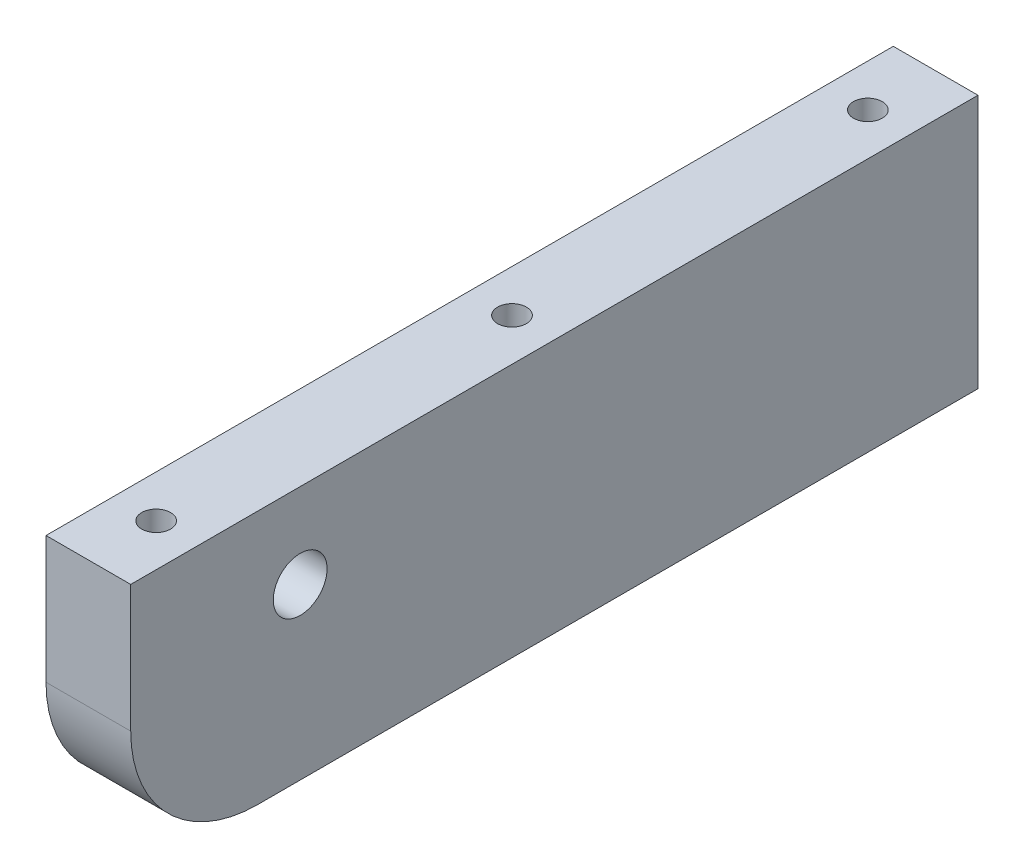
ISO-10303-21;
HEADER;
FILE_DESCRIPTION(('STEP AP214'),'2;1');
FILE_NAME('part.step','',(''),(''),'','','');
FILE_SCHEMA(('AUTOMOTIVE_DESIGN { 1 0 10303 214 1 1 1 1 }'));
ENDSEC;
DATA;
#1=APPLICATION_CONTEXT('core data for automotive mechanical design processes');
#2=APPLICATION_PROTOCOL_DEFINITION('international standard','automotive_design',2000,#1);
#3=PRODUCT_CONTEXT('',#1,'mechanical');
#4=PRODUCT('Part','Part','',(#3));
#5=PRODUCT_RELATED_PRODUCT_CATEGORY('part','',(#4));
#6=PRODUCT_DEFINITION_FORMATION('','',#4);
#7=PRODUCT_DEFINITION_CONTEXT('part definition',#1,'design');
#8=PRODUCT_DEFINITION('design','',#6,#7);
#9=PRODUCT_DEFINITION_SHAPE('','',#8);
#10=(LENGTH_UNIT() NAMED_UNIT(*) SI_UNIT(.MILLI.,.METRE.));
#11=(NAMED_UNIT(*) PLANE_ANGLE_UNIT() SI_UNIT($,.RADIAN.));
#12=(NAMED_UNIT(*) SI_UNIT($,.STERADIAN.) SOLID_ANGLE_UNIT());
#13=UNCERTAINTY_MEASURE_WITH_UNIT(LENGTH_MEASURE(1.E-05),#10,'distance_accuracy_value','');
#14=(GEOMETRIC_REPRESENTATION_CONTEXT(3) GLOBAL_UNCERTAINTY_ASSIGNED_CONTEXT((#13)) GLOBAL_UNIT_ASSIGNED_CONTEXT((#10,
#11,#12)) REPRESENTATION_CONTEXT('',''));
#15=CARTESIAN_POINT('',(0.,0.,0.));
#16=DIRECTION('',(0.,0.,1.));
#17=DIRECTION('',(1.,0.,0.));
#18=AXIS2_PLACEMENT_3D('',#15,#16,#17);
#19=CARTESIAN_POINT('',(10.,-15.,0.));
#20=DIRECTION('',(0.,1.,0.));
#21=DIRECTION('',(0.,0.,1.));
#22=AXIS2_PLACEMENT_3D('',#19,#20,#21);
#23=PLANE('',#22);
#24=DIRECTION('',(0.,0.,-1.));
#25=VECTOR('',#24,1.);
#26=CARTESIAN_POINT('',(10.,-15.,0.));
#27=LINE('',#26,#25);
#28=CARTESIAN_POINT('',(10.,-15.,35.));
#29=VERTEX_POINT('',#28);
#30=CARTESIAN_POINT('',(10.,-15.,-50.));
#31=VERTEX_POINT('',#30);
#32=EDGE_CURVE('E119',#29,#31,#27,.T.);
#33=ORIENTED_EDGE('',*,*,#32,.F.);
#34=DIRECTION('',(-1.,0.,0.));
#35=VECTOR('',#34,1.);
#36=CARTESIAN_POINT('',(0.,-15.,35.));
#37=LINE('',#36,#35);
#38=CARTESIAN_POINT('',(0.,-15.,35.));
#39=VERTEX_POINT('',#38);
#40=EDGE_CURVE('E149',#29,#39,#37,.T.);
#41=ORIENTED_EDGE('',*,*,#40,.T.);
#42=DIRECTION('',(0.,0.,-1.));
#43=VECTOR('',#42,1.);
#44=CARTESIAN_POINT('',(0.,-15.,0.));
#45=LINE('',#44,#43);
#46=CARTESIAN_POINT('',(0.,-15.,-50.));
#47=VERTEX_POINT('',#46);
#48=EDGE_CURVE('E133',#39,#47,#45,.T.);
#49=ORIENTED_EDGE('',*,*,#48,.T.);
#50=DIRECTION('',(-1.,0.,0.));
#51=VECTOR('',#50,1.);
#52=CARTESIAN_POINT('',(10.,-15.,-50.));
#53=LINE('',#52,#51);
#54=EDGE_CURVE('E146',#31,#47,#53,.T.);
#55=ORIENTED_EDGE('',*,*,#54,.F.);
#56=EDGE_LOOP('',(#33,#41,#49,#55));
#57=FACE_BOUND('',#56,.T.);
#58=ADVANCED_FACE('F41',(#57),#23,.F.);
#59=CARTESIAN_POINT('',(10.,0.,-50.));
#60=DIRECTION('',(0.,0.,1.));
#61=DIRECTION('',(1.,0.,0.));
#62=AXIS2_PLACEMENT_3D('',#59,#60,#61);
#63=PLANE('',#62);
#64=DIRECTION('',(0.,1.,0.));
#65=VECTOR('',#64,1.);
#66=CARTESIAN_POINT('',(0.,0.,-50.));
#67=LINE('',#66,#65);
#68=CARTESIAN_POINT('',(0.,15.,-50.));
#69=VERTEX_POINT('',#68);
#70=EDGE_CURVE('E135',#47,#69,#67,.T.);
#71=ORIENTED_EDGE('',*,*,#70,.T.);
#72=DIRECTION('',(-1.,0.,0.));
#73=VECTOR('',#72,1.);
#74=CARTESIAN_POINT('',(10.,15.,-50.));
#75=LINE('',#74,#73);
#76=CARTESIAN_POINT('',(10.,15.,-50.));
#77=VERTEX_POINT('',#76);
#78=EDGE_CURVE('E144',#77,#69,#75,.T.);
#79=ORIENTED_EDGE('',*,*,#78,.F.);
#80=DIRECTION('',(0.,1.,0.));
#81=VECTOR('',#80,1.);
#82=CARTESIAN_POINT('',(10.,0.,-50.));
#83=LINE('',#82,#81);
#84=EDGE_CURVE('E122',#31,#77,#83,.T.);
#85=ORIENTED_EDGE('',*,*,#84,.F.);
#86=ORIENTED_EDGE('',*,*,#54,.T.);
#87=EDGE_LOOP('',(#71,#79,#85,#86));
#88=FACE_BOUND('',#87,.T.);
#89=ADVANCED_FACE('F164',(#88),#63,.F.);
#90=CARTESIAN_POINT('',(10.,15.,0.));
#91=DIRECTION('',(0.,1.,0.));
#92=DIRECTION('',(0.,0.,1.));
#93=AXIS2_PLACEMENT_3D('',#90,#91,#92);
#94=PLANE('',#93);
#95=CARTESIAN_POINT('',(5.,15.,-42.));
#96=DIRECTION('',(0.,1.,0.));
#97=DIRECTION('',(0.,0.,1.));
#98=AXIS2_PLACEMENT_3D('',#95,#96,#97);
#99=CIRCLE('',#98,1.7);
#100=CARTESIAN_POINT('',(5.,15.,-40.3));
#101=VERTEX_POINT('',#100);
#102=EDGE_CURVE('E45',#101,#101,#99,.T.);
#103=ORIENTED_EDGE('',*,*,#102,.F.);
#104=EDGE_LOOP('',(#103));
#105=FACE_BOUND('',#104,.T.);
#106=CARTESIAN_POINT('',(5.,15.,42.));
#107=DIRECTION('',(0.,1.,0.));
#108=DIRECTION('',(0.,0.,1.));
#109=AXIS2_PLACEMENT_3D('',#106,#107,#108);
#110=CIRCLE('',#109,1.7);
#111=CARTESIAN_POINT('',(5.,15.,43.7));
#112=VERTEX_POINT('',#111);
#113=EDGE_CURVE('E111',#112,#112,#110,.T.);
#114=ORIENTED_EDGE('',*,*,#113,.F.);
#115=EDGE_LOOP('',(#114));
#116=FACE_BOUND('',#115,.T.);
#117=CARTESIAN_POINT('',(5.,15.,0.));
#118=DIRECTION('',(0.,1.,0.));
#119=DIRECTION('',(0.,0.,1.));
#120=AXIS2_PLACEMENT_3D('',#117,#118,#119);
#121=CIRCLE('',#120,1.7);
#122=CARTESIAN_POINT('',(5.,15.,1.7));
#123=VERTEX_POINT('',#122);
#124=EDGE_CURVE('E115',#123,#123,#121,.T.);
#125=ORIENTED_EDGE('',*,*,#124,.F.);
#126=EDGE_LOOP('',(#125));
#127=FACE_BOUND('',#126,.T.);
#128=DIRECTION('',(0.,0.,-1.));
#129=VECTOR('',#128,1.);
#130=CARTESIAN_POINT('',(0.,15.,0.));
#131=LINE('',#130,#129);
#132=CARTESIAN_POINT('',(0.,15.,50.));
#133=VERTEX_POINT('',#132);
#134=EDGE_CURVE('E138',#133,#69,#131,.T.);
#135=ORIENTED_EDGE('',*,*,#134,.F.);
#136=DIRECTION('',(-1.,0.,0.));
#137=VECTOR('',#136,1.);
#138=CARTESIAN_POINT('',(10.,15.,50.));
#139=LINE('',#138,#137);
#140=CARTESIAN_POINT('',(10.,15.,50.));
#141=VERTEX_POINT('',#140);
#142=EDGE_CURVE('E129',#141,#133,#139,.T.);
#143=ORIENTED_EDGE('',*,*,#142,.F.);
#144=DIRECTION('',(0.,0.,-1.));
#145=VECTOR('',#144,1.);
#146=CARTESIAN_POINT('',(10.,15.,0.));
#147=LINE('',#146,#145);
#148=EDGE_CURVE('E124',#141,#77,#147,.T.);
#149=ORIENTED_EDGE('',*,*,#148,.T.);
#150=ORIENTED_EDGE('',*,*,#78,.T.);
#151=EDGE_LOOP('',(#135,#143,#149,#150));
#152=FACE_BOUND('',#151,.T.);
#153=ADVANCED_FACE('F160',(#105,#116,#127,#152),#94,.T.);
#154=CARTESIAN_POINT('',(10.,5.,30.));
#155=DIRECTION('',(-1.,0.,0.));
#156=DIRECTION('',(0.,0.,1.));
#157=AXIS2_PLACEMENT_3D('',#154,#155,#156);
#158=CYLINDRICAL_SURFACE('',#157,3.175);
#159=CARTESIAN_POINT('',(10.,5.,30.));
#160=DIRECTION('',(1.,0.,0.));
#161=DIRECTION('',(0.,0.,-1.));
#162=AXIS2_PLACEMENT_3D('',#159,#160,#161);
#163=CIRCLE('',#162,3.175);
#164=CARTESIAN_POINT('',(10.,5.,26.825));
#165=VERTEX_POINT('',#164);
#166=EDGE_CURVE('E116',#165,#165,#163,.T.);
#167=ORIENTED_EDGE('',*,*,#166,.T.);
#168=EDGE_LOOP('',(#167));
#169=FACE_BOUND('',#168,.T.);
#170=CARTESIAN_POINT('',(0.,5.,30.));
#171=DIRECTION('',(1.,0.,0.));
#172=DIRECTION('',(0.,0.,-1.));
#173=AXIS2_PLACEMENT_3D('',#170,#171,#172);
#174=CIRCLE('',#173,3.175);
#175=CARTESIAN_POINT('',(0.,5.,26.825));
#176=VERTEX_POINT('',#175);
#177=EDGE_CURVE('E130',#176,#176,#174,.T.);
#178=ORIENTED_EDGE('',*,*,#177,.F.);
#179=EDGE_LOOP('',(#178));
#180=FACE_BOUND('',#179,.T.);
#181=ADVANCED_FACE('F163',(#169,#180),#158,.F.);
#182=CARTESIAN_POINT('',(10.,0.,50.));
#183=DIRECTION('',(0.,0.,1.));
#184=DIRECTION('',(1.,0.,0.));
#185=AXIS2_PLACEMENT_3D('',#182,#183,#184);
#186=PLANE('',#185);
#187=DIRECTION('',(0.,1.,0.));
#188=VECTOR('',#187,1.);
#189=CARTESIAN_POINT('',(0.,0.,50.));
#190=LINE('',#189,#188);
#191=CARTESIAN_POINT('',(0.,0.,50.));
#192=VERTEX_POINT('',#191);
#193=EDGE_CURVE('E120',#192,#133,#190,.T.);
#194=ORIENTED_EDGE('',*,*,#193,.F.);
#195=DIRECTION('',(-1.,0.,0.));
#196=VECTOR('',#195,1.);
#197=CARTESIAN_POINT('',(10.,0.,50.));
#198=LINE('',#197,#196);
#199=CARTESIAN_POINT('',(10.,0.,50.));
#200=VERTEX_POINT('',#199);
#201=EDGE_CURVE('E50',#192,#200,#198,.F.);
#202=ORIENTED_EDGE('',*,*,#201,.T.);
#203=DIRECTION('',(0.,1.,0.));
#204=VECTOR('',#203,1.);
#205=CARTESIAN_POINT('',(10.,0.,50.));
#206=LINE('',#205,#204);
#207=EDGE_CURVE('E127',#200,#141,#206,.T.);
#208=ORIENTED_EDGE('',*,*,#207,.T.);
#209=ORIENTED_EDGE('',*,*,#142,.T.);
#210=EDGE_LOOP('',(#194,#202,#208,#209));
#211=FACE_BOUND('',#210,.T.);
#212=ADVANCED_FACE('F175',(#211),#186,.T.);
#213=CARTESIAN_POINT('',(10.,0.,0.));
#214=DIRECTION('',(1.,0.,0.));
#215=DIRECTION('',(0.,0.,-1.));
#216=AXIS2_PLACEMENT_3D('',#213,#214,#215);
#217=PLANE('',#216);
#218=ORIENTED_EDGE('',*,*,#166,.F.);
#219=EDGE_LOOP('',(#218));
#220=FACE_BOUND('',#219,.T.);
#221=ORIENTED_EDGE('',*,*,#207,.F.);
#222=CARTESIAN_POINT('',(10.,0.,35.));
#223=DIRECTION('',(1.,0.,0.));
#224=DIRECTION('',(0.,0.,-1.));
#225=AXIS2_PLACEMENT_3D('',#222,#223,#224);
#226=CIRCLE('',#225,15.);
#227=EDGE_CURVE('E11',#200,#29,#226,.T.);
#228=ORIENTED_EDGE('',*,*,#227,.T.);
#229=ORIENTED_EDGE('',*,*,#32,.T.);
#230=ORIENTED_EDGE('',*,*,#84,.T.);
#231=ORIENTED_EDGE('',*,*,#148,.F.);
#232=EDGE_LOOP('',(#221,#228,#229,#230,#231));
#233=FACE_BOUND('',#232,.T.);
#234=ADVANCED_FACE('F178',(#220,#233),#217,.T.);
#235=CARTESIAN_POINT('',(0.,0.,0.));
#236=DIRECTION('',(1.,0.,0.));
#237=DIRECTION('',(0.,0.,-1.));
#238=AXIS2_PLACEMENT_3D('',#235,#236,#237);
#239=PLANE('',#238);
#240=ORIENTED_EDGE('',*,*,#177,.T.);
#241=EDGE_LOOP('',(#240));
#242=FACE_BOUND('',#241,.T.);
#243=ORIENTED_EDGE('',*,*,#48,.F.);
#244=CARTESIAN_POINT('',(0.,0.,35.));
#245=DIRECTION('',(1.,0.,0.));
#246=DIRECTION('',(0.,0.,-1.));
#247=AXIS2_PLACEMENT_3D('',#244,#245,#246);
#248=CIRCLE('',#247,15.);
#249=EDGE_CURVE('E65',#39,#192,#248,.F.);
#250=ORIENTED_EDGE('',*,*,#249,.T.);
#251=ORIENTED_EDGE('',*,*,#193,.T.);
#252=ORIENTED_EDGE('',*,*,#134,.T.);
#253=ORIENTED_EDGE('',*,*,#70,.F.);
#254=EDGE_LOOP('',(#243,#250,#251,#252,#253));
#255=FACE_BOUND('',#254,.T.);
#256=ADVANCED_FACE('F174',(#242,#255),#239,.F.);
#257=CARTESIAN_POINT('',(10.,0.,35.));
#258=DIRECTION('',(1.,0.,0.));
#259=DIRECTION('',(0.,0.,-1.));
#260=AXIS2_PLACEMENT_3D('',#257,#258,#259);
#261=CYLINDRICAL_SURFACE('',#260,15.);
#262=ORIENTED_EDGE('',*,*,#227,.F.);
#263=ORIENTED_EDGE('',*,*,#201,.F.);
#264=ORIENTED_EDGE('',*,*,#249,.F.);
#265=ORIENTED_EDGE('',*,*,#40,.F.);
#266=EDGE_LOOP('',(#262,#263,#264,#265));
#267=FACE_BOUND('',#266,.T.);
#268=ADVANCED_FACE('F43',(#267),#261,.T.);
#269=CARTESIAN_POINT('',(5.,2.00000000000002,0.));
#270=DIRECTION('',(0.,1.,0.));
#271=DIRECTION('',(0.,0.,1.));
#272=AXIS2_PLACEMENT_3D('',#269,#270,#271);
#273=CONICAL_SURFACE('',#272,1.69999999999999,1.02974425867665);
#274=CARTESIAN_POINT('',(5.,0.97853694765317,0.));
#275=VERTEX_POINT('',#274);
#276=VERTEX_LOOP('',#275);
#277=FACE_BOUND('',#276,.T.);
#278=CARTESIAN_POINT('',(5.,2.00000000000002,0.));
#279=DIRECTION('',(0.,1.,0.));
#280=DIRECTION('',(0.,0.,1.));
#281=AXIS2_PLACEMENT_3D('',#278,#279,#280);
#282=CIRCLE('',#281,1.69999999999999);
#283=CARTESIAN_POINT('',(5.,2.00000000000002,1.69999999999999));
#284=VERTEX_POINT('',#283);
#285=EDGE_CURVE('E112',#284,#284,#282,.T.);
#286=ORIENTED_EDGE('',*,*,#285,.T.);
#287=EDGE_LOOP('',(#286));
#288=FACE_BOUND('',#287,.T.);
#289=ADVANCED_FACE('F208',(#277,#288),#273,.F.);
#290=CARTESIAN_POINT('',(5.,25.,0.));
#291=DIRECTION('',(0.,1.,0.));
#292=DIRECTION('',(0.,0.,1.));
#293=AXIS2_PLACEMENT_3D('',#290,#291,#292);
#294=CYLINDRICAL_SURFACE('',#293,1.7);
#295=ORIENTED_EDGE('',*,*,#124,.T.);
#296=EDGE_LOOP('',(#295));
#297=FACE_BOUND('',#296,.T.);
#298=ORIENTED_EDGE('',*,*,#285,.F.);
#299=EDGE_LOOP('',(#298));
#300=FACE_BOUND('',#299,.T.);
#301=ADVANCED_FACE('F214',(#297,#300),#294,.F.);
#302=CARTESIAN_POINT('',(5.,2.00000000000002,42.));
#303=DIRECTION('',(0.,1.,0.));
#304=DIRECTION('',(0.,0.,1.));
#305=AXIS2_PLACEMENT_3D('',#302,#303,#304);
#306=CONICAL_SURFACE('',#305,1.69999999999999,1.02974425867665);
#307=CARTESIAN_POINT('',(5.,0.97853694765317,42.));
#308=VERTEX_POINT('',#307);
#309=VERTEX_LOOP('',#308);
#310=FACE_BOUND('',#309,.T.);
#311=CARTESIAN_POINT('',(5.,2.00000000000002,42.));
#312=DIRECTION('',(0.,1.,0.));
#313=DIRECTION('',(0.,0.,1.));
#314=AXIS2_PLACEMENT_3D('',#311,#312,#313);
#315=CIRCLE('',#314,1.69999999999999);
#316=CARTESIAN_POINT('',(5.,2.00000000000002,43.7));
#317=VERTEX_POINT('',#316);
#318=EDGE_CURVE('E107',#317,#317,#315,.T.);
#319=ORIENTED_EDGE('',*,*,#318,.T.);
#320=EDGE_LOOP('',(#319));
#321=FACE_BOUND('',#320,.T.);
#322=ADVANCED_FACE('F218',(#310,#321),#306,.F.);
#323=CARTESIAN_POINT('',(5.,25.,42.));
#324=DIRECTION('',(0.,1.,0.));
#325=DIRECTION('',(0.,0.,1.));
#326=AXIS2_PLACEMENT_3D('',#323,#324,#325);
#327=CYLINDRICAL_SURFACE('',#326,1.7);
#328=ORIENTED_EDGE('',*,*,#113,.T.);
#329=EDGE_LOOP('',(#328));
#330=FACE_BOUND('',#329,.T.);
#331=ORIENTED_EDGE('',*,*,#318,.F.);
#332=EDGE_LOOP('',(#331));
#333=FACE_BOUND('',#332,.T.);
#334=ADVANCED_FACE('F99',(#330,#333),#327,.F.);
#335=CARTESIAN_POINT('',(5.,2.00000000000002,-42.));
#336=DIRECTION('',(0.,1.,0.));
#337=DIRECTION('',(0.,0.,1.));
#338=AXIS2_PLACEMENT_3D('',#335,#336,#337);
#339=CONICAL_SURFACE('',#338,1.69999999999999,1.02974425867665);
#340=CARTESIAN_POINT('',(5.,0.97853694765317,-42.));
#341=VERTEX_POINT('',#340);
#342=VERTEX_LOOP('',#341);
#343=FACE_BOUND('',#342,.T.);
#344=CARTESIAN_POINT('',(5.,2.00000000000002,-42.));
#345=DIRECTION('',(0.,1.,0.));
#346=DIRECTION('',(0.,0.,1.));
#347=AXIS2_PLACEMENT_3D('',#344,#345,#346);
#348=CIRCLE('',#347,1.69999999999999);
#349=CARTESIAN_POINT('',(5.,2.00000000000002,-40.3));
#350=VERTEX_POINT('',#349);
#351=EDGE_CURVE('E103',#350,#350,#348,.T.);
#352=ORIENTED_EDGE('',*,*,#351,.T.);
#353=EDGE_LOOP('',(#352));
#354=FACE_BOUND('',#353,.T.);
#355=ADVANCED_FACE('F95',(#343,#354),#339,.F.);
#356=CARTESIAN_POINT('',(5.,25.,-42.));
#357=DIRECTION('',(0.,1.,0.));
#358=DIRECTION('',(0.,0.,1.));
#359=AXIS2_PLACEMENT_3D('',#356,#357,#358);
#360=CYLINDRICAL_SURFACE('',#359,1.7);
#361=ORIENTED_EDGE('',*,*,#102,.T.);
#362=EDGE_LOOP('',(#361));
#363=FACE_BOUND('',#362,.T.);
#364=ORIENTED_EDGE('',*,*,#351,.F.);
#365=EDGE_LOOP('',(#364));
#366=FACE_BOUND('',#365,.T.);
#367=ADVANCED_FACE('F98',(#363,#366),#360,.F.);
#368=CLOSED_SHELL('',(#58,#89,#153,#181,#212,#234,#256,#268,#289,#301,#322,#334,#355,#367));
#369=MANIFOLD_SOLID_BREP('B2',#368);
#370=ADVANCED_BREP_SHAPE_REPRESENTATION('',(#18,#369),#14);
#371=SHAPE_DEFINITION_REPRESENTATION(#9,#370);
ENDSEC;
END-ISO-10303-21;
